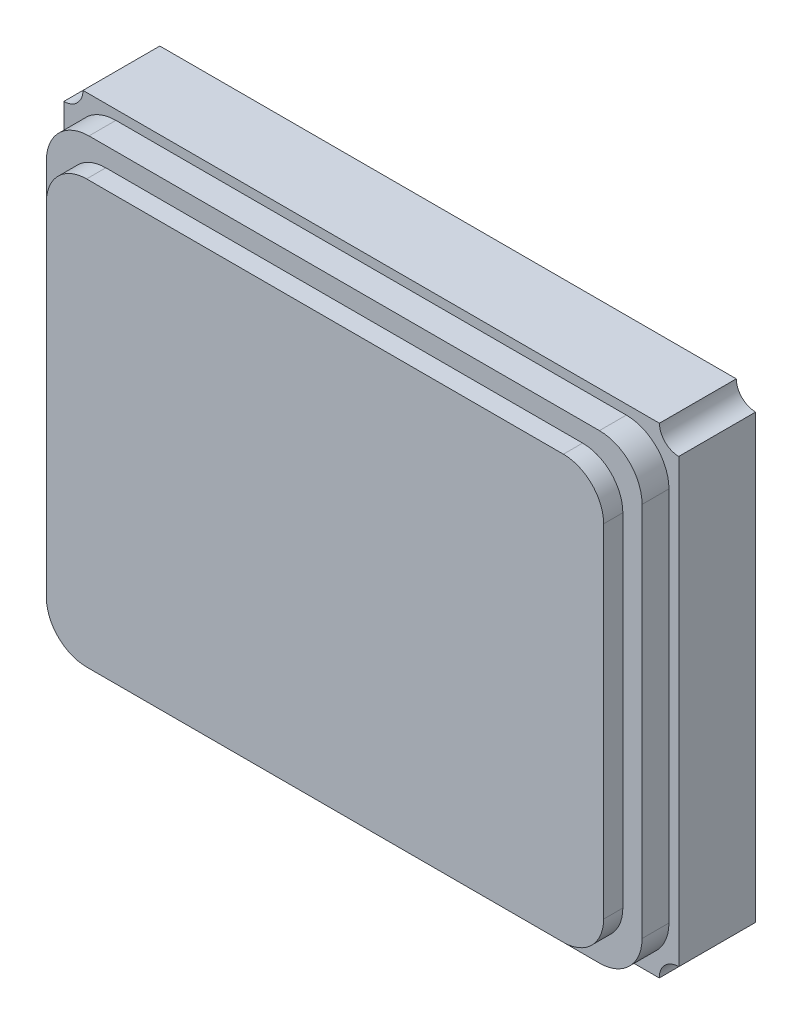
ISO-10303-21;
HEADER;
FILE_DESCRIPTION(('STEP AP214'),'2;1');
FILE_NAME('part.step','',(''),(''),'','','');
FILE_SCHEMA(('AUTOMOTIVE_DESIGN { 1 0 10303 214 1 1 1 1 }'));
ENDSEC;
DATA;
#1=APPLICATION_CONTEXT('core data for automotive mechanical design processes');
#2=APPLICATION_PROTOCOL_DEFINITION('international standard','automotive_design',2000,#1);
#3=PRODUCT_CONTEXT('',#1,'mechanical');
#4=PRODUCT('Part','Part','',(#3));
#5=PRODUCT_RELATED_PRODUCT_CATEGORY('part','',(#4));
#6=PRODUCT_DEFINITION_FORMATION('','',#4);
#7=PRODUCT_DEFINITION_CONTEXT('part definition',#1,'design');
#8=PRODUCT_DEFINITION('design','',#6,#7);
#9=PRODUCT_DEFINITION_SHAPE('','',#8);
#10=(LENGTH_UNIT() NAMED_UNIT(*) SI_UNIT(.MILLI.,.METRE.));
#11=(NAMED_UNIT(*) PLANE_ANGLE_UNIT() SI_UNIT($,.RADIAN.));
#12=(NAMED_UNIT(*) SI_UNIT($,.STERADIAN.) SOLID_ANGLE_UNIT());
#13=UNCERTAINTY_MEASURE_WITH_UNIT(LENGTH_MEASURE(1.E-05),#10,'distance_accuracy_value','');
#14=(GEOMETRIC_REPRESENTATION_CONTEXT(3) GLOBAL_UNCERTAINTY_ASSIGNED_CONTEXT((#13)) GLOBAL_UNIT_ASSIGNED_CONTEXT((#10,
#11,#12)) REPRESENTATION_CONTEXT('',''));
#15=CARTESIAN_POINT('',(0.,0.,0.));
#16=DIRECTION('',(0.,0.,1.));
#17=DIRECTION('',(1.,0.,0.));
#18=AXIS2_PLACEMENT_3D('',#15,#16,#17);
#19=CARTESIAN_POINT('',(0.0008802163144183,-0.0008850774637298,0.));
#20=DIRECTION('',(0.,0.,1.));
#21=DIRECTION('',(1.,0.,0.));
#22=AXIS2_PLACEMENT_3D('',#19,#20,#21);
#23=PLANE('',#22);
#24=DIRECTION('',(1.,0.,0.));
#25=VECTOR('',#24,1.);
#26=CARTESIAN_POINT('',(-1.499580396422,1.249506131818,0.));
#27=LINE('',#26,#25);
#28=CARTESIAN_POINT('',(-1.499580396422,1.249506131818,0.));
#29=VERTEX_POINT('',#28);
#30=CARTESIAN_POINT('',(1.500419603578,1.249506131818,0.));
#31=VERTEX_POINT('',#30);
#32=EDGE_CURVE('E305',#29,#31,#27,.T.);
#33=ORIENTED_EDGE('',*,*,#32,.T.);
#34=CARTESIAN_POINT('',(1.600419603578,1.250214196517,0.));
#35=DIRECTION('',(0.,0.,1.));
#36=DIRECTION('',(1.,0.,0.));
#37=AXIS2_PLACEMENT_3D('',#34,#35,#36);
#38=CIRCLE('',#37,0.100002506747);
#39=CARTESIAN_POINT('',(1.601127668277,1.150214196517,0.));
#40=VERTEX_POINT('',#39);
#41=EDGE_CURVE('E316',#31,#40,#38,.T.);
#42=ORIENTED_EDGE('',*,*,#41,.T.);
#43=DIRECTION('',(0.,-1.,0.));
#44=VECTOR('',#43,1.);
#45=CARTESIAN_POINT('',(1.601127668277,1.150214196517,0.));
#46=LINE('',#45,#44);
#47=CARTESIAN_POINT('',(1.601127668277,-1.149785803483,0.));
#48=VERTEX_POINT('',#47);
#49=EDGE_CURVE('E295',#40,#48,#46,.T.);
#50=ORIENTED_EDGE('',*,*,#49,.T.);
#51=CARTESIAN_POINT('',(1.599580396422,-1.249785803483,0.));
#52=DIRECTION('',(0.,0.,1.));
#53=DIRECTION('',(1.,0.,0.));
#54=AXIS2_PLACEMENT_3D('',#51,#52,#53);
#55=CIRCLE('',#54,0.100011969535);
#56=CARTESIAN_POINT('',(1.499580396422,-1.251333075338,0.));
#57=VERTEX_POINT('',#56);
#58=EDGE_CURVE('E26',#48,#57,#55,.T.);
#59=ORIENTED_EDGE('',*,*,#58,.T.);
#60=DIRECTION('',(-1.,0.,0.));
#61=VECTOR('',#60,1.);
#62=CARTESIAN_POINT('',(1.499580396422,-1.251333075338,0.));
#63=LINE('',#62,#61);
#64=CARTESIAN_POINT('',(-1.500419603578,-1.251333075338,0.));
#65=VERTEX_POINT('',#64);
#66=EDGE_CURVE('E11',#57,#65,#63,.T.);
#67=ORIENTED_EDGE('',*,*,#66,.T.);
#68=CARTESIAN_POINT('',(-1.600419603578,-1.250214196517,0.));
#69=DIRECTION('',(0.,0.,1.));
#70=DIRECTION('',(1.,0.,0.));
#71=AXIS2_PLACEMENT_3D('',#68,#69,#70);
#72=CIRCLE('',#71,0.100006259253);
#73=CARTESIAN_POINT('',(-1.599300724757,-1.150214196517,0.));
#74=VERTEX_POINT('',#73);
#75=EDGE_CURVE('E269',#65,#74,#72,.T.);
#76=ORIENTED_EDGE('',*,*,#75,.T.);
#77=DIRECTION('',(0.,1.,0.));
#78=VECTOR('',#77,1.);
#79=CARTESIAN_POINT('',(-1.599300724757,-1.150214196517,0.));
#80=LINE('',#79,#78);
#81=CARTESIAN_POINT('',(-1.599300724757,1.149785803483,0.));
#82=VERTEX_POINT('',#81);
#83=EDGE_CURVE('E296',#74,#82,#80,.T.);
#84=ORIENTED_EDGE('',*,*,#83,.T.);
#85=CARTESIAN_POINT('',(-1.599580396422,1.249785803483,0.));
#86=DIRECTION('',(0.,0.,1.));
#87=DIRECTION('',(1.,0.,0.));
#88=AXIS2_PLACEMENT_3D('',#85,#86,#87);
#89=CIRCLE('',#88,0.10000039108);
#90=EDGE_CURVE('E473',#82,#29,#89,.T.);
#91=ORIENTED_EDGE('',*,*,#90,.T.);
#92=EDGE_LOOP('',(#33,#42,#50,#59,#67,#76,#84,#91));
#93=FACE_BOUND('',#92,.T.);
#94=ADVANCED_FACE('F17',(#93),#23,.F.);
#95=CARTESIAN_POINT('',(1.499580396422,-1.251333075338,0.));
#96=DIRECTION('',(0.,-1.,0.));
#97=DIRECTION('',(0.,0.,-1.));
#98=AXIS2_PLACEMENT_3D('',#95,#96,#97);
#99=PLANE('',#98);
#100=DIRECTION('',(0.,0.,1.));
#101=VECTOR('',#100,1.);
#102=CARTESIAN_POINT('',(1.499580396422,-1.251333075338,0.));
#103=LINE('',#102,#101);
#104=CARTESIAN_POINT('',(1.499580396422,-1.251333075338,0.4));
#105=VERTEX_POINT('',#104);
#106=EDGE_CURVE('E266',#57,#105,#103,.T.);
#107=ORIENTED_EDGE('',*,*,#106,.T.);
#108=DIRECTION('',(-1.,0.,0.));
#109=VECTOR('',#108,1.);
#110=CARTESIAN_POINT('',(1.499580396422,-1.251333075338,0.4));
#111=LINE('',#110,#109);
#112=CARTESIAN_POINT('',(-1.500419603578,-1.251333075338,0.4));
#113=VERTEX_POINT('',#112);
#114=EDGE_CURVE('E424',#105,#113,#111,.T.);
#115=ORIENTED_EDGE('',*,*,#114,.T.);
#116=DIRECTION('',(0.,0.,1.));
#117=VECTOR('',#116,1.);
#118=CARTESIAN_POINT('',(-1.500419603578,-1.251333075338,0.));
#119=LINE('',#118,#117);
#120=EDGE_CURVE('E487',#65,#113,#119,.T.);
#121=ORIENTED_EDGE('',*,*,#120,.F.);
#122=ORIENTED_EDGE('',*,*,#66,.F.);
#123=EDGE_LOOP('',(#107,#115,#121,#122));
#124=FACE_BOUND('',#123,.T.);
#125=ADVANCED_FACE('F19',(#124),#99,.T.);
#126=CARTESIAN_POINT('',(1.599580396422,-1.249785803483,0.));
#127=DIRECTION('',(0.,0.,-1.));
#128=DIRECTION('',(1.,0.,0.));
#129=AXIS2_PLACEMENT_3D('',#126,#127,#128);
#130=CYLINDRICAL_SURFACE('',#129,0.100011969535);
#131=DIRECTION('',(0.,0.,1.));
#132=VECTOR('',#131,1.);
#133=CARTESIAN_POINT('',(1.601127668277,-1.149785803483,0.));
#134=LINE('',#133,#132);
#135=CARTESIAN_POINT('',(1.601127668277,-1.149785803483,0.4));
#136=VERTEX_POINT('',#135);
#137=EDGE_CURVE('E292',#48,#136,#134,.T.);
#138=ORIENTED_EDGE('',*,*,#137,.T.);
#139=CARTESIAN_POINT('',(1.599580396422,-1.249785803483,0.4));
#140=DIRECTION('',(0.,0.,1.));
#141=DIRECTION('',(1.,0.,0.));
#142=AXIS2_PLACEMENT_3D('',#139,#140,#141);
#143=CIRCLE('',#142,0.100011969535);
#144=EDGE_CURVE('E450',#136,#105,#143,.T.);
#145=ORIENTED_EDGE('',*,*,#144,.T.);
#146=ORIENTED_EDGE('',*,*,#106,.F.);
#147=ORIENTED_EDGE('',*,*,#58,.F.);
#148=EDGE_LOOP('',(#138,#145,#146,#147));
#149=FACE_BOUND('',#148,.T.);
#150=ADVANCED_FACE('F524',(#149),#130,.F.);
#151=CARTESIAN_POINT('',(-1.600419603578,-1.250214196517,0.));
#152=DIRECTION('',(0.,0.,-1.));
#153=DIRECTION('',(1.,0.,0.));
#154=AXIS2_PLACEMENT_3D('',#151,#152,#153);
#155=CYLINDRICAL_SURFACE('',#154,0.100006259253);
#156=ORIENTED_EDGE('',*,*,#120,.T.);
#157=CARTESIAN_POINT('',(-1.600419603578,-1.250214196517,0.4));
#158=DIRECTION('',(0.,0.,1.));
#159=DIRECTION('',(1.,0.,0.));
#160=AXIS2_PLACEMENT_3D('',#157,#158,#159);
#161=CIRCLE('',#160,0.100006259253);
#162=CARTESIAN_POINT('',(-1.599300724757,-1.150214196517,0.4));
#163=VERTEX_POINT('',#162);
#164=EDGE_CURVE('E420',#113,#163,#161,.T.);
#165=ORIENTED_EDGE('',*,*,#164,.T.);
#166=DIRECTION('',(0.,0.,1.));
#167=VECTOR('',#166,1.);
#168=CARTESIAN_POINT('',(-1.599300724757,-1.150214196517,0.));
#169=LINE('',#168,#167);
#170=EDGE_CURVE('E313',#74,#163,#169,.T.);
#171=ORIENTED_EDGE('',*,*,#170,.F.);
#172=ORIENTED_EDGE('',*,*,#75,.F.);
#173=EDGE_LOOP('',(#156,#165,#171,#172));
#174=FACE_BOUND('',#173,.T.);
#175=ADVANCED_FACE('F498',(#174),#155,.F.);
#176=CARTESIAN_POINT('',(1.601127668277,1.150214196517,0.));
#177=DIRECTION('',(1.,0.,0.));
#178=DIRECTION('',(0.,1.,0.));
#179=AXIS2_PLACEMENT_3D('',#176,#177,#178);
#180=PLANE('',#179);
#181=DIRECTION('',(0.,0.,1.));
#182=VECTOR('',#181,1.);
#183=CARTESIAN_POINT('',(1.601127668277,1.150214196517,0.));
#184=LINE('',#183,#182);
#185=CARTESIAN_POINT('',(1.601127668277,1.150214196517,0.4));
#186=VERTEX_POINT('',#185);
#187=EDGE_CURVE('E476',#40,#186,#184,.T.);
#188=ORIENTED_EDGE('',*,*,#187,.T.);
#189=DIRECTION('',(0.,-1.,0.));
#190=VECTOR('',#189,1.);
#191=CARTESIAN_POINT('',(1.601127668277,1.150214196517,0.4));
#192=LINE('',#191,#190);
#193=EDGE_CURVE('E454',#186,#136,#192,.T.);
#194=ORIENTED_EDGE('',*,*,#193,.T.);
#195=ORIENTED_EDGE('',*,*,#137,.F.);
#196=ORIENTED_EDGE('',*,*,#49,.F.);
#197=EDGE_LOOP('',(#188,#194,#195,#196));
#198=FACE_BOUND('',#197,.T.);
#199=ADVANCED_FACE('F521',(#198),#180,.T.);
#200=CARTESIAN_POINT('',(-1.599300724757,-1.150214196517,0.));
#201=DIRECTION('',(-1.,0.,0.));
#202=DIRECTION('',(0.,0.,1.));
#203=AXIS2_PLACEMENT_3D('',#200,#201,#202);
#204=PLANE('',#203);
#205=ORIENTED_EDGE('',*,*,#170,.T.);
#206=DIRECTION('',(0.,1.,0.));
#207=VECTOR('',#206,1.);
#208=CARTESIAN_POINT('',(-1.599300724757,-1.150214196517,0.4));
#209=LINE('',#208,#207);
#210=CARTESIAN_POINT('',(-1.599300724757,1.149785803483,0.4));
#211=VERTEX_POINT('',#210);
#212=EDGE_CURVE('E321',#163,#211,#209,.T.);
#213=ORIENTED_EDGE('',*,*,#212,.T.);
#214=DIRECTION('',(0.,0.,1.));
#215=VECTOR('',#214,1.);
#216=CARTESIAN_POINT('',(-1.599300724757,1.149785803483,0.));
#217=LINE('',#216,#215);
#218=EDGE_CURVE('E309',#82,#211,#217,.T.);
#219=ORIENTED_EDGE('',*,*,#218,.F.);
#220=ORIENTED_EDGE('',*,*,#83,.F.);
#221=EDGE_LOOP('',(#205,#213,#219,#220));
#222=FACE_BOUND('',#221,.T.);
#223=ADVANCED_FACE('F497',(#222),#204,.T.);
#224=CARTESIAN_POINT('',(1.600419603578,1.250214196517,0.));
#225=DIRECTION('',(0.,0.,-1.));
#226=DIRECTION('',(1.,0.,0.));
#227=AXIS2_PLACEMENT_3D('',#224,#225,#226);
#228=CYLINDRICAL_SURFACE('',#227,0.100002506747);
#229=DIRECTION('',(0.,0.,1.));
#230=VECTOR('',#229,1.);
#231=CARTESIAN_POINT('',(1.500419603578,1.249506131818,0.));
#232=LINE('',#231,#230);
#233=CARTESIAN_POINT('',(1.500419603578,1.249506131818,0.4));
#234=VERTEX_POINT('',#233);
#235=EDGE_CURVE('E310',#31,#234,#232,.T.);
#236=ORIENTED_EDGE('',*,*,#235,.T.);
#237=CARTESIAN_POINT('',(1.600419603578,1.250214196517,0.4));
#238=DIRECTION('',(0.,0.,1.));
#239=DIRECTION('',(1.,0.,0.));
#240=AXIS2_PLACEMENT_3D('',#237,#238,#239);
#241=CIRCLE('',#240,0.100002506747);
#242=EDGE_CURVE('E370',#234,#186,#241,.T.);
#243=ORIENTED_EDGE('',*,*,#242,.T.);
#244=ORIENTED_EDGE('',*,*,#187,.F.);
#245=ORIENTED_EDGE('',*,*,#41,.F.);
#246=EDGE_LOOP('',(#236,#243,#244,#245));
#247=FACE_BOUND('',#246,.T.);
#248=ADVANCED_FACE('F515',(#247),#228,.F.);
#249=CARTESIAN_POINT('',(-1.599580396422,1.249785803483,0.));
#250=DIRECTION('',(0.,0.,-1.));
#251=DIRECTION('',(1.,0.,0.));
#252=AXIS2_PLACEMENT_3D('',#249,#250,#251);
#253=CYLINDRICAL_SURFACE('',#252,0.10000039108);
#254=ORIENTED_EDGE('',*,*,#218,.T.);
#255=CARTESIAN_POINT('',(-1.599580396422,1.249785803483,0.4));
#256=DIRECTION('',(0.,0.,1.));
#257=DIRECTION('',(1.,0.,0.));
#258=AXIS2_PLACEMENT_3D('',#255,#256,#257);
#259=CIRCLE('',#258,0.10000039108);
#260=CARTESIAN_POINT('',(-1.499580396422,1.249506131818,0.4));
#261=VERTEX_POINT('',#260);
#262=EDGE_CURVE('E317',#211,#261,#259,.T.);
#263=ORIENTED_EDGE('',*,*,#262,.T.);
#264=DIRECTION('',(0.,0.,1.));
#265=VECTOR('',#264,1.);
#266=CARTESIAN_POINT('',(-1.499580396422,1.249506131818,0.));
#267=LINE('',#266,#265);
#268=EDGE_CURVE('E367',#29,#261,#267,.T.);
#269=ORIENTED_EDGE('',*,*,#268,.F.);
#270=ORIENTED_EDGE('',*,*,#90,.F.);
#271=EDGE_LOOP('',(#254,#263,#269,#270));
#272=FACE_BOUND('',#271,.T.);
#273=ADVANCED_FACE('F509',(#272),#253,.F.);
#274=CARTESIAN_POINT('',(-1.499580396422,1.249506131818,0.));
#275=DIRECTION('',(0.,1.,0.));
#276=DIRECTION('',(1.,0.,0.));
#277=AXIS2_PLACEMENT_3D('',#274,#275,#276);
#278=PLANE('',#277);
#279=ORIENTED_EDGE('',*,*,#268,.T.);
#280=DIRECTION('',(1.,0.,0.));
#281=VECTOR('',#280,1.);
#282=CARTESIAN_POINT('',(-1.499580396422,1.249506131818,0.4));
#283=LINE('',#282,#281);
#284=EDGE_CURVE('E322',#261,#234,#283,.T.);
#285=ORIENTED_EDGE('',*,*,#284,.T.);
#286=ORIENTED_EDGE('',*,*,#235,.F.);
#287=ORIENTED_EDGE('',*,*,#32,.F.);
#288=EDGE_LOOP('',(#279,#285,#286,#287));
#289=FACE_BOUND('',#288,.T.);
#290=ADVANCED_FACE('F513',(#289),#278,.T.);
#291=CARTESIAN_POINT('',(0.0008802163144183,-0.0008850774637298,0.4));
#292=DIRECTION('',(0.,0.,1.));
#293=DIRECTION('',(1.,0.,0.));
#294=AXIS2_PLACEMENT_3D('',#291,#292,#293);
#295=PLANE('',#294);
#296=CARTESIAN_POINT('',(1.328205850256,-0.978205850256,0.4));
#297=DIRECTION('',(0.,0.,-1.));
#298=DIRECTION('',(1.,0.,0.));
#299=AXIS2_PLACEMENT_3D('',#296,#297,#298);
#300=CIRCLE('',#299,0.221794149744);
#301=CARTESIAN_POINT('',(1.55,-0.978205850256,0.4));
#302=VERTEX_POINT('',#301);
#303=CARTESIAN_POINT('',(1.328205850256,-1.2,0.4));
#304=VERTEX_POINT('',#303);
#305=EDGE_CURVE('E427',#302,#304,#300,.T.);
#306=ORIENTED_EDGE('',*,*,#305,.T.);
#307=DIRECTION('',(-1.,0.,0.));
#308=VECTOR('',#307,1.);
#309=CARTESIAN_POINT('',(-0.663662816971,-1.2,0.4));
#310=LINE('',#309,#308);
#311=CARTESIAN_POINT('',(-1.328205850256,-1.2,0.4));
#312=VERTEX_POINT('',#311);
#313=EDGE_CURVE('E400',#304,#312,#310,.T.);
#314=ORIENTED_EDGE('',*,*,#313,.T.);
#315=CARTESIAN_POINT('',(-1.328205850256,-0.978205850256,0.4));
#316=DIRECTION('',(0.,0.,-1.));
#317=DIRECTION('',(1.,0.,0.));
#318=AXIS2_PLACEMENT_3D('',#315,#316,#317);
#319=CIRCLE('',#318,0.221794149744);
#320=CARTESIAN_POINT('',(-1.55,-0.978205850256,0.4));
#321=VERTEX_POINT('',#320);
#322=EDGE_CURVE('E407',#312,#321,#319,.T.);
#323=ORIENTED_EDGE('',*,*,#322,.T.);
#324=DIRECTION('',(0.,1.,0.));
#325=VECTOR('',#324,1.);
#326=CARTESIAN_POINT('',(-1.55,0.488660386396,0.4));
#327=LINE('',#326,#325);
#328=CARTESIAN_POINT('',(-1.55,0.978205850256,0.4));
#329=VERTEX_POINT('',#328);
#330=EDGE_CURVE('E433',#321,#329,#327,.T.);
#331=ORIENTED_EDGE('',*,*,#330,.T.);
#332=CARTESIAN_POINT('',(-1.328205850256,0.978205850256,0.4));
#333=DIRECTION('',(0.,0.,-1.));
#334=DIRECTION('',(1.,0.,0.));
#335=AXIS2_PLACEMENT_3D('',#332,#333,#334);
#336=CIRCLE('',#335,0.221794149744);
#337=CARTESIAN_POINT('',(-1.328205850256,1.2,0.4));
#338=VERTEX_POINT('',#337);
#339=EDGE_CURVE('E408',#329,#338,#336,.T.);
#340=ORIENTED_EDGE('',*,*,#339,.T.);
#341=DIRECTION('',(1.,0.,0.));
#342=VECTOR('',#341,1.);
#343=CARTESIAN_POINT('',(0.664543033285,1.2,0.4));
#344=LINE('',#343,#342);
#345=CARTESIAN_POINT('',(1.328205850256,1.2,0.4));
#346=VERTEX_POINT('',#345);
#347=EDGE_CURVE('E386',#338,#346,#344,.T.);
#348=ORIENTED_EDGE('',*,*,#347,.T.);
#349=CARTESIAN_POINT('',(1.328205850256,0.978205850256,0.4));
#350=DIRECTION('',(0.,0.,-1.));
#351=DIRECTION('',(1.,0.,0.));
#352=AXIS2_PLACEMENT_3D('',#349,#350,#351);
#353=CIRCLE('',#352,0.221794149744);
#354=CARTESIAN_POINT('',(1.55,0.978205850256,0.4));
#355=VERTEX_POINT('',#354);
#356=EDGE_CURVE('E445',#346,#355,#353,.T.);
#357=ORIENTED_EDGE('',*,*,#356,.T.);
#358=DIRECTION('',(0.,-1.,0.));
#359=VECTOR('',#358,1.);
#360=CARTESIAN_POINT('',(1.55,-0.48954546386,0.4));
#361=LINE('',#360,#359);
#362=EDGE_CURVE('E440',#355,#302,#361,.T.);
#363=ORIENTED_EDGE('',*,*,#362,.T.);
#364=EDGE_LOOP('',(#306,#314,#323,#331,#340,#348,#357,#363));
#365=FACE_BOUND('',#364,.T.);
#366=ORIENTED_EDGE('',*,*,#284,.F.);
#367=ORIENTED_EDGE('',*,*,#262,.F.);
#368=ORIENTED_EDGE('',*,*,#212,.F.);
#369=ORIENTED_EDGE('',*,*,#164,.F.);
#370=ORIENTED_EDGE('',*,*,#114,.F.);
#371=ORIENTED_EDGE('',*,*,#144,.F.);
#372=ORIENTED_EDGE('',*,*,#193,.F.);
#373=ORIENTED_EDGE('',*,*,#242,.F.);
#374=EDGE_LOOP('',(#366,#367,#368,#369,#370,#371,#372,#373));
#375=FACE_BOUND('',#374,.T.);
#376=ADVANCED_FACE('F505',(#365,#375),#295,.T.);
#377=CARTESIAN_POINT('',(1.328205850256,1.2,0.39));
#378=DIRECTION('',(0.,-1.,0.));
#379=DIRECTION('',(0.,0.,-1.));
#380=AXIS2_PLACEMENT_3D('',#377,#378,#379);
#381=PLANE('',#380);
#382=DIRECTION('',(0.,0.,1.));
#383=VECTOR('',#382,1.);
#384=CARTESIAN_POINT('',(-1.328205850256,1.2,0.39));
#385=LINE('',#384,#383);
#386=CARTESIAN_POINT('',(-1.328205850256,1.2,0.54));
#387=VERTEX_POINT('',#386);
#388=EDGE_CURVE('E413',#338,#387,#385,.T.);
#389=ORIENTED_EDGE('',*,*,#388,.T.);
#390=DIRECTION('',(-1.,0.,0.));
#391=VECTOR('',#390,1.);
#392=CARTESIAN_POINT('',(1.328205850256,1.2,0.54));
#393=LINE('',#392,#391);
#394=CARTESIAN_POINT('',(1.328205850256,1.2,0.54));
#395=VERTEX_POINT('',#394);
#396=EDGE_CURVE('E302',#395,#387,#393,.T.);
#397=ORIENTED_EDGE('',*,*,#396,.F.);
#398=DIRECTION('',(0.,0.,1.));
#399=VECTOR('',#398,1.);
#400=CARTESIAN_POINT('',(1.328205850256,1.2,0.39));
#401=LINE('',#400,#399);
#402=EDGE_CURVE('E412',#346,#395,#401,.T.);
#403=ORIENTED_EDGE('',*,*,#402,.F.);
#404=ORIENTED_EDGE('',*,*,#347,.F.);
#405=EDGE_LOOP('',(#389,#397,#403,#404));
#406=FACE_BOUND('',#405,.T.);
#407=ADVANCED_FACE('F553',(#406),#381,.F.);
#408=CARTESIAN_POINT('',(1.328205850256,0.978205850256,0.39));
#409=DIRECTION('',(0.,0.,-1.));
#410=DIRECTION('',(1.,0.,0.));
#411=AXIS2_PLACEMENT_3D('',#408,#409,#410);
#412=CYLINDRICAL_SURFACE('',#411,0.221794149744);
#413=ORIENTED_EDGE('',*,*,#402,.T.);
#414=CARTESIAN_POINT('',(1.328205850256,0.978205850256,0.54));
#415=DIRECTION('',(0.,0.,1.));
#416=DIRECTION('',(1.,0.,0.));
#417=AXIS2_PLACEMENT_3D('',#414,#415,#416);
#418=CIRCLE('',#417,0.221794149744);
#419=CARTESIAN_POINT('',(1.55,0.978205850256,0.54));
#420=VERTEX_POINT('',#419);
#421=EDGE_CURVE('E376',#420,#395,#418,.T.);
#422=ORIENTED_EDGE('',*,*,#421,.F.);
#423=DIRECTION('',(0.,0.,1.));
#424=VECTOR('',#423,1.);
#425=CARTESIAN_POINT('',(1.55,0.978205850256,0.39));
#426=LINE('',#425,#424);
#427=EDGE_CURVE('E437',#355,#420,#426,.T.);
#428=ORIENTED_EDGE('',*,*,#427,.F.);
#429=ORIENTED_EDGE('',*,*,#356,.F.);
#430=EDGE_LOOP('',(#413,#422,#428,#429));
#431=FACE_BOUND('',#430,.T.);
#432=ADVANCED_FACE('F557',(#431),#412,.T.);
#433=CARTESIAN_POINT('',(-1.328205850256,0.978205850256,0.39));
#434=DIRECTION('',(0.,0.,-1.));
#435=DIRECTION('',(1.,0.,0.));
#436=AXIS2_PLACEMENT_3D('',#433,#434,#435);
#437=CYLINDRICAL_SURFACE('',#436,0.221794149744);
#438=DIRECTION('',(0.,0.,1.));
#439=VECTOR('',#438,1.);
#440=CARTESIAN_POINT('',(-1.55,0.978205850256,0.39));
#441=LINE('',#440,#439);
#442=CARTESIAN_POINT('',(-1.55,0.978205850256,0.54));
#443=VERTEX_POINT('',#442);
#444=EDGE_CURVE('E430',#329,#443,#441,.T.);
#445=ORIENTED_EDGE('',*,*,#444,.T.);
#446=CARTESIAN_POINT('',(-1.328205850256,0.978205850256,0.54));
#447=DIRECTION('',(0.,0.,1.));
#448=DIRECTION('',(1.,0.,0.));
#449=AXIS2_PLACEMENT_3D('',#446,#447,#448);
#450=CIRCLE('',#449,0.221794149744);
#451=EDGE_CURVE('E297',#387,#443,#450,.T.);
#452=ORIENTED_EDGE('',*,*,#451,.F.);
#453=ORIENTED_EDGE('',*,*,#388,.F.);
#454=ORIENTED_EDGE('',*,*,#339,.F.);
#455=EDGE_LOOP('',(#445,#452,#453,#454));
#456=FACE_BOUND('',#455,.T.);
#457=ADVANCED_FACE('F561',(#456),#437,.T.);
#458=CARTESIAN_POINT('',(1.55,-0.978205850256,0.39));
#459=DIRECTION('',(-1.,0.,0.));
#460=DIRECTION('',(0.,0.,1.));
#461=AXIS2_PLACEMENT_3D('',#458,#459,#460);
#462=PLANE('',#461);
#463=ORIENTED_EDGE('',*,*,#427,.T.);
#464=DIRECTION('',(0.,1.,0.));
#465=VECTOR('',#464,1.);
#466=CARTESIAN_POINT('',(1.55,-0.978205850256,0.54));
#467=LINE('',#466,#465);
#468=CARTESIAN_POINT('',(1.55,-0.978205850256,0.54));
#469=VERTEX_POINT('',#468);
#470=EDGE_CURVE('E360',#469,#420,#467,.T.);
#471=ORIENTED_EDGE('',*,*,#470,.F.);
#472=DIRECTION('',(0.,0.,1.));
#473=VECTOR('',#472,1.);
#474=CARTESIAN_POINT('',(1.55,-0.978205850256,0.39));
#475=LINE('',#474,#473);
#476=EDGE_CURVE('E417',#302,#469,#475,.T.);
#477=ORIENTED_EDGE('',*,*,#476,.F.);
#478=ORIENTED_EDGE('',*,*,#362,.F.);
#479=EDGE_LOOP('',(#463,#471,#477,#478));
#480=FACE_BOUND('',#479,.T.);
#481=ADVANCED_FACE('F567',(#480),#462,.F.);
#482=CARTESIAN_POINT('',(-1.55,0.978205850256,0.39));
#483=DIRECTION('',(1.,0.,0.));
#484=DIRECTION('',(0.,1.,0.));
#485=AXIS2_PLACEMENT_3D('',#482,#483,#484);
#486=PLANE('',#485);
#487=DIRECTION('',(0.,0.,1.));
#488=VECTOR('',#487,1.);
#489=CARTESIAN_POINT('',(-1.55,-0.978205850256,0.39));
#490=LINE('',#489,#488);
#491=CARTESIAN_POINT('',(-1.55,-0.978205850256,0.54));
#492=VERTEX_POINT('',#491);
#493=EDGE_CURVE('E404',#321,#492,#490,.T.);
#494=ORIENTED_EDGE('',*,*,#493,.T.);
#495=DIRECTION('',(0.,-1.,0.));
#496=VECTOR('',#495,1.);
#497=CARTESIAN_POINT('',(-1.55,0.978205850256,0.54));
#498=LINE('',#497,#496);
#499=EDGE_CURVE('E301',#443,#492,#498,.T.);
#500=ORIENTED_EDGE('',*,*,#499,.F.);
#501=ORIENTED_EDGE('',*,*,#444,.F.);
#502=ORIENTED_EDGE('',*,*,#330,.F.);
#503=EDGE_LOOP('',(#494,#500,#501,#502));
#504=FACE_BOUND('',#503,.T.);
#505=ADVANCED_FACE('F563',(#504),#486,.F.);
#506=CARTESIAN_POINT('',(1.328205850256,-0.978205850256,0.39));
#507=DIRECTION('',(0.,0.,-1.));
#508=DIRECTION('',(1.,0.,0.));
#509=AXIS2_PLACEMENT_3D('',#506,#507,#508);
#510=CYLINDRICAL_SURFACE('',#509,0.221794149744);
#511=ORIENTED_EDGE('',*,*,#476,.T.);
#512=CARTESIAN_POINT('',(1.328205850256,-0.978205850256,0.54));
#513=DIRECTION('',(0.,0.,1.));
#514=DIRECTION('',(1.,0.,0.));
#515=AXIS2_PLACEMENT_3D('',#512,#513,#514);
#516=CIRCLE('',#515,0.221794149744);
#517=CARTESIAN_POINT('',(1.328205850256,-1.2,0.54));
#518=VERTEX_POINT('',#517);
#519=EDGE_CURVE('E327',#518,#469,#516,.T.);
#520=ORIENTED_EDGE('',*,*,#519,.F.);
#521=DIRECTION('',(0.,0.,1.));
#522=VECTOR('',#521,1.);
#523=CARTESIAN_POINT('',(1.328205850256,-1.2,0.39));
#524=LINE('',#523,#522);
#525=EDGE_CURVE('E394',#304,#518,#524,.T.);
#526=ORIENTED_EDGE('',*,*,#525,.F.);
#527=ORIENTED_EDGE('',*,*,#305,.F.);
#528=EDGE_LOOP('',(#511,#520,#526,#527));
#529=FACE_BOUND('',#528,.T.);
#530=ADVANCED_FACE('F566',(#529),#510,.T.);
#531=CARTESIAN_POINT('',(-1.328205850256,-0.978205850256,0.39));
#532=DIRECTION('',(0.,0.,-1.));
#533=DIRECTION('',(1.,0.,0.));
#534=AXIS2_PLACEMENT_3D('',#531,#532,#533);
#535=CYLINDRICAL_SURFACE('',#534,0.221794149744);
#536=DIRECTION('',(0.,0.,1.));
#537=VECTOR('',#536,1.);
#538=CARTESIAN_POINT('',(-1.328205850256,-1.2,0.39));
#539=LINE('',#538,#537);
#540=CARTESIAN_POINT('',(-1.328205850256,-1.2,0.54));
#541=VERTEX_POINT('',#540);
#542=EDGE_CURVE('E397',#312,#541,#539,.T.);
#543=ORIENTED_EDGE('',*,*,#542,.T.);
#544=CARTESIAN_POINT('',(-1.328205850256,-0.978205850256,0.54));
#545=DIRECTION('',(0.,0.,1.));
#546=DIRECTION('',(1.,0.,0.));
#547=AXIS2_PLACEMENT_3D('',#544,#545,#546);
#548=CIRCLE('',#547,0.221794149744);
#549=EDGE_CURVE('E390',#492,#541,#548,.T.);
#550=ORIENTED_EDGE('',*,*,#549,.F.);
#551=ORIENTED_EDGE('',*,*,#493,.F.);
#552=ORIENTED_EDGE('',*,*,#322,.F.);
#553=EDGE_LOOP('',(#543,#550,#551,#552));
#554=FACE_BOUND('',#553,.T.);
#555=ADVANCED_FACE('F571',(#554),#535,.T.);
#556=CARTESIAN_POINT('',(-1.328205850256,-1.2,0.39));
#557=DIRECTION('',(0.,1.,0.));
#558=DIRECTION('',(1.,0.,0.));
#559=AXIS2_PLACEMENT_3D('',#556,#557,#558);
#560=PLANE('',#559);
#561=ORIENTED_EDGE('',*,*,#525,.T.);
#562=DIRECTION('',(1.,0.,0.));
#563=VECTOR('',#562,1.);
#564=CARTESIAN_POINT('',(-1.328205850256,-1.2,0.54));
#565=LINE('',#564,#563);
#566=EDGE_CURVE('E323',#541,#518,#565,.T.);
#567=ORIENTED_EDGE('',*,*,#566,.F.);
#568=ORIENTED_EDGE('',*,*,#542,.F.);
#569=ORIENTED_EDGE('',*,*,#313,.F.);
#570=EDGE_LOOP('',(#561,#567,#568,#569));
#571=FACE_BOUND('',#570,.T.);
#572=ADVANCED_FACE('F576',(#571),#560,.F.);
#573=CARTESIAN_POINT('',(0.,0.,0.54));
#574=DIRECTION('',(0.,0.,1.));
#575=DIRECTION('',(1.,0.,0.));
#576=AXIS2_PLACEMENT_3D('',#573,#574,#575);
#577=PLANE('',#576);
#578=DIRECTION('',(1.,0.,0.));
#579=VECTOR('',#578,1.);
#580=CARTESIAN_POINT('',(-1.240692780974,-1.1,0.54));
#581=LINE('',#580,#579);
#582=CARTESIAN_POINT('',(-1.240692780974,-1.1,0.54));
#583=VERTEX_POINT('',#582);
#584=CARTESIAN_POINT('',(1.240692780974,-1.1,0.54));
#585=VERTEX_POINT('',#584);
#586=EDGE_CURVE('E253',#583,#585,#581,.T.);
#587=ORIENTED_EDGE('',*,*,#586,.F.);
#588=CARTESIAN_POINT('',(-1.240692780974,-0.890692780974,0.54));
#589=DIRECTION('',(0.,0.,1.));
#590=DIRECTION('',(1.,0.,0.));
#591=AXIS2_PLACEMENT_3D('',#588,#589,#590);
#592=CIRCLE('',#591,0.209307219026);
#593=CARTESIAN_POINT('',(-1.45,-0.890692780974,0.54));
#594=VERTEX_POINT('',#593);
#595=EDGE_CURVE('E235',#594,#583,#592,.T.);
#596=ORIENTED_EDGE('',*,*,#595,.F.);
#597=DIRECTION('',(0.,-1.,0.));
#598=VECTOR('',#597,1.);
#599=CARTESIAN_POINT('',(-1.45,0.890692780974,0.54));
#600=LINE('',#599,#598);
#601=CARTESIAN_POINT('',(-1.45,0.890692780974,0.54));
#602=VERTEX_POINT('',#601);
#603=EDGE_CURVE('E356',#602,#594,#600,.T.);
#604=ORIENTED_EDGE('',*,*,#603,.F.);
#605=CARTESIAN_POINT('',(-1.240692780974,0.890692780974,0.54));
#606=DIRECTION('',(0.,0.,1.));
#607=DIRECTION('',(1.,0.,0.));
#608=AXIS2_PLACEMENT_3D('',#605,#606,#607);
#609=CIRCLE('',#608,0.209307219026);
#610=CARTESIAN_POINT('',(-1.240692780974,1.1,0.54));
#611=VERTEX_POINT('',#610);
#612=EDGE_CURVE('E331',#611,#602,#609,.T.);
#613=ORIENTED_EDGE('',*,*,#612,.F.);
#614=DIRECTION('',(-1.,0.,0.));
#615=VECTOR('',#614,1.);
#616=CARTESIAN_POINT('',(1.240692780974,1.1,0.54));
#617=LINE('',#616,#615);
#618=CARTESIAN_POINT('',(1.240692780974,1.1,0.54));
#619=VERTEX_POINT('',#618);
#620=EDGE_CURVE('E332',#619,#611,#617,.T.);
#621=ORIENTED_EDGE('',*,*,#620,.F.);
#622=CARTESIAN_POINT('',(1.240692780974,0.890692780974,0.54));
#623=DIRECTION('',(0.,0.,1.));
#624=DIRECTION('',(1.,0.,0.));
#625=AXIS2_PLACEMENT_3D('',#622,#623,#624);
#626=CIRCLE('',#625,0.209307219026);
#627=CARTESIAN_POINT('',(1.45,0.890692780974,0.54));
#628=VERTEX_POINT('',#627);
#629=EDGE_CURVE('E284',#628,#619,#626,.T.);
#630=ORIENTED_EDGE('',*,*,#629,.F.);
#631=DIRECTION('',(0.,1.,0.));
#632=VECTOR('',#631,1.);
#633=CARTESIAN_POINT('',(1.45,-0.890692780974,0.54));
#634=LINE('',#633,#632);
#635=CARTESIAN_POINT('',(1.45,-0.890692780974,0.54));
#636=VERTEX_POINT('',#635);
#637=EDGE_CURVE('E333',#636,#628,#634,.T.);
#638=ORIENTED_EDGE('',*,*,#637,.F.);
#639=CARTESIAN_POINT('',(1.240692780974,-0.890692780974,0.54));
#640=DIRECTION('',(0.,0.,1.));
#641=DIRECTION('',(1.,0.,0.));
#642=AXIS2_PLACEMENT_3D('',#639,#640,#641);
#643=CIRCLE('',#642,0.209307219026);
#644=EDGE_CURVE('E241',#585,#636,#643,.T.);
#645=ORIENTED_EDGE('',*,*,#644,.F.);
#646=EDGE_LOOP('',(#587,#596,#604,#613,#621,#630,#638,#645));
#647=FACE_BOUND('',#646,.T.);
#648=ORIENTED_EDGE('',*,*,#566,.T.);
#649=ORIENTED_EDGE('',*,*,#519,.T.);
#650=ORIENTED_EDGE('',*,*,#470,.T.);
#651=ORIENTED_EDGE('',*,*,#421,.T.);
#652=ORIENTED_EDGE('',*,*,#396,.T.);
#653=ORIENTED_EDGE('',*,*,#451,.T.);
#654=ORIENTED_EDGE('',*,*,#499,.T.);
#655=ORIENTED_EDGE('',*,*,#549,.T.);
#656=EDGE_LOOP('',(#648,#649,#650,#651,#652,#653,#654,#655));
#657=FACE_BOUND('',#656,.T.);
#658=ADVANCED_FACE('F573',(#647,#657),#577,.T.);
#659=CARTESIAN_POINT('',(-1.240692780974,-0.890692780974,0.54));
#660=DIRECTION('',(0.,0.,-1.));
#661=DIRECTION('',(1.,0.,0.));
#662=AXIS2_PLACEMENT_3D('',#659,#660,#661);
#663=CYLINDRICAL_SURFACE('',#662,0.209307219026);
#664=ORIENTED_EDGE('',*,*,#595,.T.);
#665=DIRECTION('',(0.,0.,1.));
#666=VECTOR('',#665,1.);
#667=CARTESIAN_POINT('',(-1.240692780974,-1.1,0.54));
#668=LINE('',#667,#666);
#669=CARTESIAN_POINT('',(-1.240692780974,-1.1,0.64));
#670=VERTEX_POINT('',#669);
#671=EDGE_CURVE('E229',#583,#670,#668,.T.);
#672=ORIENTED_EDGE('',*,*,#671,.T.);
#673=CARTESIAN_POINT('',(-1.240692780974,-0.890692780974,0.64));
#674=DIRECTION('',(0.,0.,1.));
#675=DIRECTION('',(1.,0.,0.));
#676=AXIS2_PLACEMENT_3D('',#673,#674,#675);
#677=CIRCLE('',#676,0.209307219026);
#678=CARTESIAN_POINT('',(-1.45,-0.890692780974,0.64));
#679=VERTEX_POINT('',#678);
#680=EDGE_CURVE('E233',#679,#670,#677,.T.);
#681=ORIENTED_EDGE('',*,*,#680,.F.);
#682=DIRECTION('',(0.,0.,1.));
#683=VECTOR('',#682,1.);
#684=CARTESIAN_POINT('',(-1.45,-0.890692780974,0.54));
#685=LINE('',#684,#683);
#686=EDGE_CURVE('E364',#594,#679,#685,.T.);
#687=ORIENTED_EDGE('',*,*,#686,.F.);
#688=EDGE_LOOP('',(#664,#672,#681,#687));
#689=FACE_BOUND('',#688,.T.);
#690=ADVANCED_FACE('F231',(#689),#663,.T.);
#691=CARTESIAN_POINT('',(-1.45,0.890692780974,0.54));
#692=DIRECTION('',(1.,0.,0.));
#693=DIRECTION('',(0.,1.,0.));
#694=AXIS2_PLACEMENT_3D('',#691,#692,#693);
#695=PLANE('',#694);
#696=ORIENTED_EDGE('',*,*,#603,.T.);
#697=ORIENTED_EDGE('',*,*,#686,.T.);
#698=DIRECTION('',(0.,-1.,0.));
#699=VECTOR('',#698,1.);
#700=CARTESIAN_POINT('',(-1.45,0.890692780974,0.64));
#701=LINE('',#700,#699);
#702=CARTESIAN_POINT('',(-1.45,0.890692780974,0.64));
#703=VERTEX_POINT('',#702);
#704=EDGE_CURVE('E251',#703,#679,#701,.T.);
#705=ORIENTED_EDGE('',*,*,#704,.F.);
#706=DIRECTION('',(0.,0.,1.));
#707=VECTOR('',#706,1.);
#708=CARTESIAN_POINT('',(-1.45,0.890692780974,0.54));
#709=LINE('',#708,#707);
#710=EDGE_CURVE('E353',#602,#703,#709,.T.);
#711=ORIENTED_EDGE('',*,*,#710,.F.);
#712=EDGE_LOOP('',(#696,#697,#705,#711));
#713=FACE_BOUND('',#712,.T.);
#714=ADVANCED_FACE('F580',(#713),#695,.F.);
#715=CARTESIAN_POINT('',(-1.240692780974,0.890692780974,0.54));
#716=DIRECTION('',(0.,0.,-1.));
#717=DIRECTION('',(1.,0.,0.));
#718=AXIS2_PLACEMENT_3D('',#715,#716,#717);
#719=CYLINDRICAL_SURFACE('',#718,0.209307219026);
#720=ORIENTED_EDGE('',*,*,#612,.T.);
#721=ORIENTED_EDGE('',*,*,#710,.T.);
#722=CARTESIAN_POINT('',(-1.240692780974,0.890692780974,0.64));
#723=DIRECTION('',(0.,0.,1.));
#724=DIRECTION('',(1.,0.,0.));
#725=AXIS2_PLACEMENT_3D('',#722,#723,#724);
#726=CIRCLE('',#725,0.209307219026);
#727=CARTESIAN_POINT('',(-1.240692780974,1.1,0.64));
#728=VERTEX_POINT('',#727);
#729=EDGE_CURVE('E280',#728,#703,#726,.T.);
#730=ORIENTED_EDGE('',*,*,#729,.F.);
#731=DIRECTION('',(0.,0.,1.));
#732=VECTOR('',#731,1.);
#733=CARTESIAN_POINT('',(-1.240692780974,1.1,0.54));
#734=LINE('',#733,#732);
#735=EDGE_CURVE('E328',#611,#728,#734,.T.);
#736=ORIENTED_EDGE('',*,*,#735,.F.);
#737=EDGE_LOOP('',(#720,#721,#730,#736));
#738=FACE_BOUND('',#737,.T.);
#739=ADVANCED_FACE('F583',(#738),#719,.T.);
#740=CARTESIAN_POINT('',(1.240692780974,1.1,0.54));
#741=DIRECTION('',(0.,-1.,0.));
#742=DIRECTION('',(0.,0.,-1.));
#743=AXIS2_PLACEMENT_3D('',#740,#741,#742);
#744=PLANE('',#743);
#745=ORIENTED_EDGE('',*,*,#620,.T.);
#746=ORIENTED_EDGE('',*,*,#735,.T.);
#747=DIRECTION('',(-1.,0.,0.));
#748=VECTOR('',#747,1.);
#749=CARTESIAN_POINT('',(1.240692780974,1.1,0.64));
#750=LINE('',#749,#748);
#751=CARTESIAN_POINT('',(1.240692780974,1.1,0.64));
#752=VERTEX_POINT('',#751);
#753=EDGE_CURVE('E277',#752,#728,#750,.T.);
#754=ORIENTED_EDGE('',*,*,#753,.F.);
#755=DIRECTION('',(0.,0.,1.));
#756=VECTOR('',#755,1.);
#757=CARTESIAN_POINT('',(1.240692780974,1.1,0.54));
#758=LINE('',#757,#756);
#759=EDGE_CURVE('E288',#619,#752,#758,.T.);
#760=ORIENTED_EDGE('',*,*,#759,.F.);
#761=EDGE_LOOP('',(#745,#746,#754,#760));
#762=FACE_BOUND('',#761,.T.);
#763=ADVANCED_FACE('F588',(#762),#744,.F.);
#764=CARTESIAN_POINT('',(1.240692780974,0.890692780974,0.54));
#765=DIRECTION('',(0.,0.,-1.));
#766=DIRECTION('',(1.,0.,0.));
#767=AXIS2_PLACEMENT_3D('',#764,#765,#766);
#768=CYLINDRICAL_SURFACE('',#767,0.209307219026);
#769=ORIENTED_EDGE('',*,*,#629,.T.);
#770=ORIENTED_EDGE('',*,*,#759,.T.);
#771=CARTESIAN_POINT('',(1.240692780974,0.890692780974,0.64));
#772=DIRECTION('',(0.,0.,1.));
#773=DIRECTION('',(1.,0.,0.));
#774=AXIS2_PLACEMENT_3D('',#771,#772,#773);
#775=CIRCLE('',#774,0.209307219026);
#776=CARTESIAN_POINT('',(1.45,0.890692780974,0.64));
#777=VERTEX_POINT('',#776);
#778=EDGE_CURVE('E272',#777,#752,#775,.T.);
#779=ORIENTED_EDGE('',*,*,#778,.F.);
#780=DIRECTION('',(0.,0.,1.));
#781=VECTOR('',#780,1.);
#782=CARTESIAN_POINT('',(1.45,0.890692780974,0.54));
#783=LINE('',#782,#781);
#784=EDGE_CURVE('E289',#628,#777,#783,.T.);
#785=ORIENTED_EDGE('',*,*,#784,.F.);
#786=EDGE_LOOP('',(#769,#770,#779,#785));
#787=FACE_BOUND('',#786,.T.);
#788=ADVANCED_FACE('F590',(#787),#768,.T.);
#789=CARTESIAN_POINT('',(1.45,-0.890692780974,0.54));
#790=DIRECTION('',(-1.,0.,0.));
#791=DIRECTION('',(0.,0.,1.));
#792=AXIS2_PLACEMENT_3D('',#789,#790,#791);
#793=PLANE('',#792);
#794=ORIENTED_EDGE('',*,*,#637,.T.);
#795=ORIENTED_EDGE('',*,*,#784,.T.);
#796=DIRECTION('',(0.,1.,0.));
#797=VECTOR('',#796,1.);
#798=CARTESIAN_POINT('',(1.45,-0.890692780974,0.64));
#799=LINE('',#798,#797);
#800=CARTESIAN_POINT('',(1.45,-0.890692780974,0.64));
#801=VERTEX_POINT('',#800);
#802=EDGE_CURVE('E263',#801,#777,#799,.T.);
#803=ORIENTED_EDGE('',*,*,#802,.F.);
#804=DIRECTION('',(0.,0.,1.));
#805=VECTOR('',#804,1.);
#806=CARTESIAN_POINT('',(1.45,-0.890692780974,0.54));
#807=LINE('',#806,#805);
#808=EDGE_CURVE('E337',#636,#801,#807,.T.);
#809=ORIENTED_EDGE('',*,*,#808,.F.);
#810=EDGE_LOOP('',(#794,#795,#803,#809));
#811=FACE_BOUND('',#810,.T.);
#812=ADVANCED_FACE('F598',(#811),#793,.F.);
#813=CARTESIAN_POINT('',(1.240692780974,-0.890692780974,0.54));
#814=DIRECTION('',(0.,0.,-1.));
#815=DIRECTION('',(1.,0.,0.));
#816=AXIS2_PLACEMENT_3D('',#813,#814,#815);
#817=CYLINDRICAL_SURFACE('',#816,0.209307219026);
#818=ORIENTED_EDGE('',*,*,#644,.T.);
#819=ORIENTED_EDGE('',*,*,#808,.T.);
#820=CARTESIAN_POINT('',(1.240692780974,-0.890692780974,0.64));
#821=DIRECTION('',(0.,0.,1.));
#822=DIRECTION('',(1.,0.,0.));
#823=AXIS2_PLACEMENT_3D('',#820,#821,#822);
#824=CIRCLE('',#823,0.209307219026);
#825=CARTESIAN_POINT('',(1.240692780974,-1.1,0.64));
#826=VERTEX_POINT('',#825);
#827=EDGE_CURVE('E259',#826,#801,#824,.T.);
#828=ORIENTED_EDGE('',*,*,#827,.F.);
#829=DIRECTION('',(0.,0.,1.));
#830=VECTOR('',#829,1.);
#831=CARTESIAN_POINT('',(1.240692780974,-1.1,0.54));
#832=LINE('',#831,#830);
#833=EDGE_CURVE('E242',#585,#826,#832,.T.);
#834=ORIENTED_EDGE('',*,*,#833,.F.);
#835=EDGE_LOOP('',(#818,#819,#828,#834));
#836=FACE_BOUND('',#835,.T.);
#837=ADVANCED_FACE('F604',(#836),#817,.T.);
#838=CARTESIAN_POINT('',(-1.240692780974,-1.1,0.54));
#839=DIRECTION('',(0.,1.,0.));
#840=DIRECTION('',(1.,0.,0.));
#841=AXIS2_PLACEMENT_3D('',#838,#839,#840);
#842=PLANE('',#841);
#843=ORIENTED_EDGE('',*,*,#586,.T.);
#844=ORIENTED_EDGE('',*,*,#833,.T.);
#845=DIRECTION('',(1.,0.,0.));
#846=VECTOR('',#845,1.);
#847=CARTESIAN_POINT('',(-1.240692780974,-1.1,0.64));
#848=LINE('',#847,#846);
#849=EDGE_CURVE('E248',#670,#826,#848,.T.);
#850=ORIENTED_EDGE('',*,*,#849,.F.);
#851=ORIENTED_EDGE('',*,*,#671,.F.);
#852=EDGE_LOOP('',(#843,#844,#850,#851));
#853=FACE_BOUND('',#852,.T.);
#854=ADVANCED_FACE('F255',(#853),#842,.F.);
#855=CARTESIAN_POINT('',(0.,0.,0.64));
#856=DIRECTION('',(0.,0.,1.));
#857=DIRECTION('',(0.,-1.,0.));
#858=AXIS2_PLACEMENT_3D('',#855,#856,#857);
#859=PLANE('',#858);
#860=ORIENTED_EDGE('',*,*,#849,.T.);
#861=ORIENTED_EDGE('',*,*,#827,.T.);
#862=ORIENTED_EDGE('',*,*,#802,.T.);
#863=ORIENTED_EDGE('',*,*,#778,.T.);
#864=ORIENTED_EDGE('',*,*,#753,.T.);
#865=ORIENTED_EDGE('',*,*,#729,.T.);
#866=ORIENTED_EDGE('',*,*,#704,.T.);
#867=ORIENTED_EDGE('',*,*,#680,.T.);
#868=EDGE_LOOP('',(#860,#861,#862,#863,#864,#865,#866,#867));
#869=FACE_BOUND('',#868,.T.);
#870=ADVANCED_FACE('F246',(#869),#859,.T.);
#871=CLOSED_SHELL('',(#94,#125,#150,#175,#199,#223,#248,#273,#290,#376,#407,#432,#457,#481,#505,
#530,#555,#572,#658,#690,#714,#739,#763,#788,#812,#837,#854,#870));
#872=MANIFOLD_SOLID_BREP('B1',#871);
#873=ADVANCED_BREP_SHAPE_REPRESENTATION('',(#18,#872),#14);
#874=SHAPE_DEFINITION_REPRESENTATION(#9,#873);
ENDSEC;
END-ISO-10303-21;
